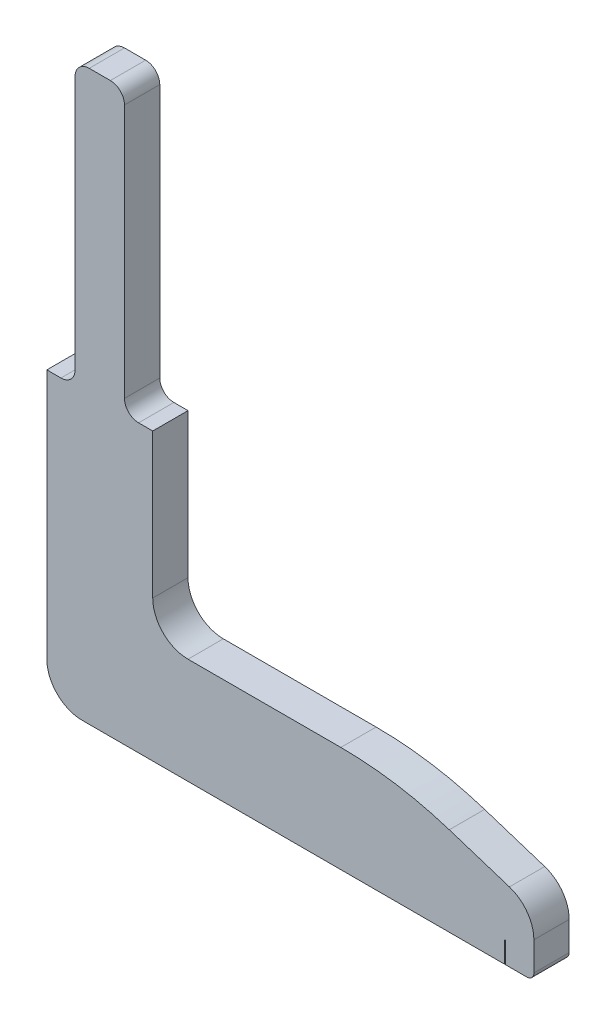
ISO-10303-21;
HEADER;
FILE_DESCRIPTION(('STEP AP214'),'2;1');
FILE_NAME('part.step','',(''),(''),'','','');
FILE_SCHEMA(('AUTOMOTIVE_DESIGN { 1 0 10303 214 1 1 1 1 }'));
ENDSEC;
DATA;
#1=APPLICATION_CONTEXT('core data for automotive mechanical design processes');
#2=APPLICATION_PROTOCOL_DEFINITION('international standard','automotive_design',2000,#1);
#3=PRODUCT_CONTEXT('',#1,'mechanical');
#4=PRODUCT('Part','Part','',(#3));
#5=PRODUCT_RELATED_PRODUCT_CATEGORY('part','',(#4));
#6=PRODUCT_DEFINITION_FORMATION('','',#4);
#7=PRODUCT_DEFINITION_CONTEXT('part definition',#1,'design');
#8=PRODUCT_DEFINITION('design','',#6,#7);
#9=PRODUCT_DEFINITION_SHAPE('','',#8);
#10=(LENGTH_UNIT() NAMED_UNIT(*) SI_UNIT(.MILLI.,.METRE.));
#11=(NAMED_UNIT(*) PLANE_ANGLE_UNIT() SI_UNIT($,.RADIAN.));
#12=(NAMED_UNIT(*) SI_UNIT($,.STERADIAN.) SOLID_ANGLE_UNIT());
#13=UNCERTAINTY_MEASURE_WITH_UNIT(LENGTH_MEASURE(1.E-05),#10,'distance_accuracy_value','');
#14=(GEOMETRIC_REPRESENTATION_CONTEXT(3) GLOBAL_UNCERTAINTY_ASSIGNED_CONTEXT((#13)) GLOBAL_UNIT_ASSIGNED_CONTEXT((#10,
#11,#12)) REPRESENTATION_CONTEXT('',''));
#15=CARTESIAN_POINT('',(0.,0.,0.));
#16=DIRECTION('',(0.,0.,1.));
#17=DIRECTION('',(1.,0.,0.));
#18=AXIS2_PLACEMENT_3D('',#15,#16,#17);
#19=CARTESIAN_POINT('',(5.,-40.5,5.));
#20=DIRECTION('',(0.,1.,0.));
#21=DIRECTION('',(-1.,0.,0.));
#22=AXIS2_PLACEMENT_3D('',#19,#20,#21);
#23=PLANE('',#22);
#24=DIRECTION('',(1.,0.,0.));
#25=VECTOR('',#24,1.);
#26=CARTESIAN_POINT('',(5.,-40.5,5.));
#27=LINE('',#26,#25);
#28=CARTESIAN_POINT('',(64.95,-40.5,5.));
#29=VERTEX_POINT('',#28);
#30=CARTESIAN_POINT('',(68.,-40.5,5.));
#31=VERTEX_POINT('',#30);
#32=EDGE_CURVE('E243',#29,#31,#27,.T.);
#33=ORIENTED_EDGE('',*,*,#32,.F.);
#34=DIRECTION('',(0.,0.,1.));
#35=VECTOR('',#34,1.);
#36=CARTESIAN_POINT('',(64.95,-40.5,0.));
#37=LINE('',#36,#35);
#38=CARTESIAN_POINT('',(64.95,-40.5,0.));
#39=VERTEX_POINT('',#38);
#40=EDGE_CURVE('E204',#39,#29,#37,.T.);
#41=ORIENTED_EDGE('',*,*,#40,.F.);
#42=DIRECTION('',(1.,0.,0.));
#43=VECTOR('',#42,1.);
#44=CARTESIAN_POINT('',(5.,-40.5,0.));
#45=LINE('',#44,#43);
#46=CARTESIAN_POINT('',(68.,-40.5,0.));
#47=VERTEX_POINT('',#46);
#48=EDGE_CURVE('E277',#39,#47,#45,.T.);
#49=ORIENTED_EDGE('',*,*,#48,.T.);
#50=DIRECTION('',(0.,0.,-1.));
#51=VECTOR('',#50,1.);
#52=CARTESIAN_POINT('',(68.,-40.5,5.));
#53=LINE('',#52,#51);
#54=EDGE_CURVE('E332',#31,#47,#53,.T.);
#55=ORIENTED_EDGE('',*,*,#54,.F.);
#56=EDGE_LOOP('',(#33,#41,#49,#55));
#57=FACE_BOUND('',#56,.T.);
#58=ADVANCED_FACE('F36',(#57),#23,.F.);
#59=CARTESIAN_POINT('',(0.,0.,5.));
#60=DIRECTION('',(0.,-1.,0.));
#61=DIRECTION('',(1.,0.,0.));
#62=AXIS2_PLACEMENT_3D('',#59,#60,#61);
#63=PLANE('',#62);
#64=DIRECTION('',(-1.,0.,0.));
#65=VECTOR('',#64,1.);
#66=CARTESIAN_POINT('',(4.,0.,5.));
#67=LINE('',#66,#65);
#68=CARTESIAN_POINT('',(2.,0.,5.));
#69=VERTEX_POINT('',#68);
#70=CARTESIAN_POINT('',(0.,0.,5.));
#71=VERTEX_POINT('',#70);
#72=EDGE_CURVE('E236',#69,#71,#67,.T.);
#73=ORIENTED_EDGE('',*,*,#72,.F.);
#74=DIRECTION('',(0.,0.,-1.));
#75=VECTOR('',#74,1.);
#76=CARTESIAN_POINT('',(2.,0.,0.));
#77=LINE('',#76,#75);
#78=CARTESIAN_POINT('',(2.,0.,0.));
#79=VERTEX_POINT('',#78);
#80=EDGE_CURVE('E366',#69,#79,#77,.T.);
#81=ORIENTED_EDGE('',*,*,#80,.T.);
#82=DIRECTION('',(-1.,0.,0.));
#83=VECTOR('',#82,1.);
#84=CARTESIAN_POINT('',(0.,0.,0.));
#85=LINE('',#84,#83);
#86=CARTESIAN_POINT('',(0.,0.,0.));
#87=VERTEX_POINT('',#86);
#88=EDGE_CURVE('E231',#79,#87,#85,.T.);
#89=ORIENTED_EDGE('',*,*,#88,.T.);
#90=DIRECTION('',(0.,0.,-1.));
#91=VECTOR('',#90,1.);
#92=CARTESIAN_POINT('',(0.,0.,5.));
#93=LINE('',#92,#91);
#94=EDGE_CURVE('E341',#71,#87,#93,.T.);
#95=ORIENTED_EDGE('',*,*,#94,.F.);
#96=EDGE_LOOP('',(#73,#81,#89,#95));
#97=FACE_BOUND('',#96,.T.);
#98=ADVANCED_FACE('F408',(#97),#63,.F.);
#99=CARTESIAN_POINT('',(0.,-1.00000000000001,5.));
#100=DIRECTION('',(1.,0.,0.));
#101=DIRECTION('',(0.,1.,0.));
#102=AXIS2_PLACEMENT_3D('',#99,#100,#101);
#103=PLANE('',#102);
#104=DIRECTION('',(0.,-1.,0.));
#105=VECTOR('',#104,1.);
#106=CARTESIAN_POINT('',(0.,-1.00000000000001,0.));
#107=LINE('',#106,#105);
#108=CARTESIAN_POINT('',(0.,-35.5,0.));
#109=VERTEX_POINT('',#108);
#110=EDGE_CURVE('E273',#87,#109,#107,.T.);
#111=ORIENTED_EDGE('',*,*,#110,.T.);
#112=DIRECTION('',(0.,0.,-1.));
#113=VECTOR('',#112,1.);
#114=CARTESIAN_POINT('',(0.,-35.5,5.));
#115=LINE('',#114,#113);
#116=CARTESIAN_POINT('',(0.,-35.5,5.));
#117=VERTEX_POINT('',#116);
#118=EDGE_CURVE('E338',#117,#109,#115,.T.);
#119=ORIENTED_EDGE('',*,*,#118,.F.);
#120=DIRECTION('',(0.,-1.,0.));
#121=VECTOR('',#120,1.);
#122=CARTESIAN_POINT('',(0.,-1.00000000000001,5.));
#123=LINE('',#122,#121);
#124=EDGE_CURVE('E238',#71,#117,#123,.T.);
#125=ORIENTED_EDGE('',*,*,#124,.F.);
#126=ORIENTED_EDGE('',*,*,#94,.T.);
#127=EDGE_LOOP('',(#111,#119,#125,#126));
#128=FACE_BOUND('',#127,.T.);
#129=ADVANCED_FACE('F416',(#128),#103,.F.);
#130=CARTESIAN_POINT('',(5.,-35.5,5.));
#131=DIRECTION('',(0.,0.,-1.));
#132=DIRECTION('',(-1.,0.,0.));
#133=AXIS2_PLACEMENT_3D('',#130,#131,#132);
#134=CYLINDRICAL_SURFACE('',#133,4.99999999999999);
#135=CARTESIAN_POINT('',(5.,-35.5,0.));
#136=DIRECTION('',(0.,0.,1.));
#137=DIRECTION('',(-1.,0.,0.));
#138=AXIS2_PLACEMENT_3D('',#135,#136,#137);
#139=CIRCLE('',#138,4.99999999999999);
#140=CARTESIAN_POINT('',(5.00000000000001,-40.5,0.));
#141=VERTEX_POINT('',#140);
#142=EDGE_CURVE('E275',#109,#141,#139,.T.);
#143=ORIENTED_EDGE('',*,*,#142,.T.);
#144=DIRECTION('',(0.,0.,-1.));
#145=VECTOR('',#144,1.);
#146=CARTESIAN_POINT('',(5.00000000000001,-40.5,5.));
#147=LINE('',#146,#145);
#148=CARTESIAN_POINT('',(5.00000000000001,-40.5,5.));
#149=VERTEX_POINT('',#148);
#150=EDGE_CURVE('E335',#149,#141,#147,.T.);
#151=ORIENTED_EDGE('',*,*,#150,.F.);
#152=CARTESIAN_POINT('',(5.,-35.5,5.));
#153=DIRECTION('',(0.,0.,1.));
#154=DIRECTION('',(-1.,0.,0.));
#155=AXIS2_PLACEMENT_3D('',#152,#153,#154);
#156=CIRCLE('',#155,4.99999999999999);
#157=EDGE_CURVE('E241',#117,#149,#156,.T.);
#158=ORIENTED_EDGE('',*,*,#157,.F.);
#159=ORIENTED_EDGE('',*,*,#118,.T.);
#160=EDGE_LOOP('',(#143,#151,#158,#159));
#161=FACE_BOUND('',#160,.T.);
#162=ADVANCED_FACE('F421',(#161),#134,.T.);
#163=CARTESIAN_POINT('',(64.85,-40.5,0.));
#164=VERTEX_POINT('',#163);
#165=EDGE_CURVE('E278',#141,#164,#45,.T.);
#166=ORIENTED_EDGE('',*,*,#165,.T.);
#167=DIRECTION('',(0.,0.,-1.));
#168=VECTOR('',#167,1.);
#169=CARTESIAN_POINT('',(64.85,-40.5,0.));
#170=LINE('',#169,#168);
#171=CARTESIAN_POINT('',(64.85,-40.5,5.));
#172=VERTEX_POINT('',#171);
#173=EDGE_CURVE('E217',#172,#164,#170,.T.);
#174=ORIENTED_EDGE('',*,*,#173,.F.);
#175=EDGE_CURVE('E244',#149,#172,#27,.T.);
#176=ORIENTED_EDGE('',*,*,#175,.F.);
#177=ORIENTED_EDGE('',*,*,#150,.T.);
#178=EDGE_LOOP('',(#166,#174,#176,#177));
#179=FACE_BOUND('',#178,.T.);
#180=ADVANCED_FACE('F424',(#179),#23,.F.);
#181=CARTESIAN_POINT('',(68.,-39.5,5.));
#182=DIRECTION('',(0.,0.,-1.));
#183=DIRECTION('',(-1.,0.,0.));
#184=AXIS2_PLACEMENT_3D('',#181,#182,#183);
#185=CYLINDRICAL_SURFACE('',#184,1.);
#186=CARTESIAN_POINT('',(68.,-39.5,0.));
#187=DIRECTION('',(0.,0.,1.));
#188=DIRECTION('',(-1.,0.,0.));
#189=AXIS2_PLACEMENT_3D('',#186,#187,#188);
#190=CIRCLE('',#189,1.);
#191=CARTESIAN_POINT('',(69.,-39.5,0.));
#192=VERTEX_POINT('',#191);
#193=EDGE_CURVE('E281',#47,#192,#190,.T.);
#194=ORIENTED_EDGE('',*,*,#193,.T.);
#195=DIRECTION('',(0.,0.,-1.));
#196=VECTOR('',#195,1.);
#197=CARTESIAN_POINT('',(69.,-39.5,5.));
#198=LINE('',#197,#196);
#199=CARTESIAN_POINT('',(69.,-39.5,5.));
#200=VERTEX_POINT('',#199);
#201=EDGE_CURVE('E329',#200,#192,#198,.T.);
#202=ORIENTED_EDGE('',*,*,#201,.F.);
#203=CARTESIAN_POINT('',(68.,-39.5,5.));
#204=DIRECTION('',(0.,0.,1.));
#205=DIRECTION('',(-1.,0.,0.));
#206=AXIS2_PLACEMENT_3D('',#203,#204,#205);
#207=CIRCLE('',#206,1.);
#208=EDGE_CURVE('E246',#31,#200,#207,.T.);
#209=ORIENTED_EDGE('',*,*,#208,.F.);
#210=ORIENTED_EDGE('',*,*,#54,.T.);
#211=EDGE_LOOP('',(#194,#202,#209,#210));
#212=FACE_BOUND('',#211,.T.);
#213=ADVANCED_FACE('F437',(#212),#185,.T.);
#214=CARTESIAN_POINT('',(69.,-39.5,5.));
#215=DIRECTION('',(-1.,0.,0.));
#216=DIRECTION('',(0.,0.,1.));
#217=AXIS2_PLACEMENT_3D('',#214,#215,#216);
#218=PLANE('',#217);
#219=DIRECTION('',(0.,1.,0.));
#220=VECTOR('',#219,1.);
#221=CARTESIAN_POINT('',(69.,-39.5,0.));
#222=LINE('',#221,#220);
#223=CARTESIAN_POINT('',(69.,-35.4299960458088,0.));
#224=VERTEX_POINT('',#223);
#225=EDGE_CURVE('E283',#192,#224,#222,.T.);
#226=ORIENTED_EDGE('',*,*,#225,.T.);
#227=DIRECTION('',(0.,0.,-1.));
#228=VECTOR('',#227,1.);
#229=CARTESIAN_POINT('',(69.,-35.4299960458088,5.));
#230=LINE('',#229,#228);
#231=CARTESIAN_POINT('',(69.,-35.4299960458088,5.));
#232=VERTEX_POINT('',#231);
#233=EDGE_CURVE('E326',#232,#224,#230,.T.);
#234=ORIENTED_EDGE('',*,*,#233,.F.);
#235=DIRECTION('',(0.,1.,0.));
#236=VECTOR('',#235,1.);
#237=CARTESIAN_POINT('',(69.,-39.5,5.));
#238=LINE('',#237,#236);
#239=EDGE_CURVE('E248',#200,#232,#238,.T.);
#240=ORIENTED_EDGE('',*,*,#239,.F.);
#241=ORIENTED_EDGE('',*,*,#201,.T.);
#242=EDGE_LOOP('',(#226,#234,#240,#241));
#243=FACE_BOUND('',#242,.T.);
#244=ADVANCED_FACE('F440',(#243),#218,.F.);
#245=CARTESIAN_POINT('',(64.,-35.4299960458088,5.));
#246=DIRECTION('',(0.,0.,-1.));
#247=DIRECTION('',(-1.,0.,0.));
#248=AXIS2_PLACEMENT_3D('',#245,#246,#247);
#249=CYLINDRICAL_SURFACE('',#248,5.);
#250=CARTESIAN_POINT('',(64.,-35.4299960458088,0.));
#251=DIRECTION('',(0.,0.,1.));
#252=DIRECTION('',(-1.,0.,0.));
#253=AXIS2_PLACEMENT_3D('',#250,#251,#252);
#254=CIRCLE('',#253,5.);
#255=CARTESIAN_POINT('',(65.536877429929,-30.6720544987346,0.));
#256=VERTEX_POINT('',#255);
#257=EDGE_CURVE('E285',#224,#256,#254,.T.);
#258=ORIENTED_EDGE('',*,*,#257,.T.);
#259=DIRECTION('',(0.,0.,-1.));
#260=VECTOR('',#259,1.);
#261=CARTESIAN_POINT('',(65.536877429929,-30.6720544987346,5.));
#262=LINE('',#261,#260);
#263=CARTESIAN_POINT('',(65.536877429929,-30.6720544987346,5.));
#264=VERTEX_POINT('',#263);
#265=EDGE_CURVE('E323',#264,#256,#262,.T.);
#266=ORIENTED_EDGE('',*,*,#265,.F.);
#267=CARTESIAN_POINT('',(64.,-35.4299960458088,5.));
#268=DIRECTION('',(0.,0.,1.));
#269=DIRECTION('',(-1.,0.,0.));
#270=AXIS2_PLACEMENT_3D('',#267,#268,#269);
#271=CIRCLE('',#270,5.);
#272=EDGE_CURVE('E250',#232,#264,#271,.T.);
#273=ORIENTED_EDGE('',*,*,#272,.F.);
#274=ORIENTED_EDGE('',*,*,#233,.T.);
#275=EDGE_LOOP('',(#258,#266,#273,#274));
#276=FACE_BOUND('',#275,.T.);
#277=ADVANCED_FACE('F445',(#276),#249,.T.);
#278=CARTESIAN_POINT('',(65.536877429929,-30.6720544987346,5.));
#279=DIRECTION('',(-0.307375485985791,-0.951588309414843,0.));
#280=DIRECTION('',(0.951588309414843,-0.307375485985791,0.));
#281=AXIS2_PLACEMENT_3D('',#278,#279,#280);
#282=PLANE('',#281);
#283=DIRECTION('',(-0.951588309414843,0.307375485985791,0.));
#284=VECTOR('',#283,1.);
#285=CARTESIAN_POINT('',(65.536877429929,-30.6720544987346,0.));
#286=LINE('',#285,#284);
#287=CARTESIAN_POINT('',(57.018739920482,-27.9205845292579,0.));
#288=VERTEX_POINT('',#287);
#289=EDGE_CURVE('E287',#256,#288,#286,.T.);
#290=ORIENTED_EDGE('',*,*,#289,.T.);
#291=DIRECTION('',(0.,0.,-1.));
#292=VECTOR('',#291,1.);
#293=CARTESIAN_POINT('',(57.018739920482,-27.9205845292579,5.));
#294=LINE('',#293,#292);
#295=CARTESIAN_POINT('',(57.018739920482,-27.9205845292579,5.));
#296=VERTEX_POINT('',#295);
#297=EDGE_CURVE('E320',#296,#288,#294,.T.);
#298=ORIENTED_EDGE('',*,*,#297,.F.);
#299=DIRECTION('',(-0.951588309414843,0.307375485985791,0.));
#300=VECTOR('',#299,1.);
#301=CARTESIAN_POINT('',(65.536877429929,-30.6720544987346,5.));
#302=LINE('',#301,#300);
#303=EDGE_CURVE('E252',#264,#296,#302,.T.);
#304=ORIENTED_EDGE('',*,*,#303,.F.);
#305=ORIENTED_EDGE('',*,*,#265,.T.);
#306=EDGE_LOOP('',(#290,#298,#304,#305));
#307=FACE_BOUND('',#306,.T.);
#308=ADVANCED_FACE('F451',(#307),#282,.F.);
#309=CARTESIAN_POINT('',(41.6499656211925,-75.5,5.));
#310=DIRECTION('',(0.,0.,-1.));
#311=DIRECTION('',(-1.,0.,0.));
#312=AXIS2_PLACEMENT_3D('',#309,#310,#311);
#313=CYLINDRICAL_SURFACE('',#312,50.);
#314=CARTESIAN_POINT('',(41.6499656211925,-75.5,0.));
#315=DIRECTION('',(0.,0.,1.));
#316=DIRECTION('',(-1.,0.,0.));
#317=AXIS2_PLACEMENT_3D('',#314,#315,#316);
#318=CIRCLE('',#317,50.);
#319=CARTESIAN_POINT('',(41.6499656211925,-25.5,0.));
#320=VERTEX_POINT('',#319);
#321=EDGE_CURVE('E289',#288,#320,#318,.T.);
#322=ORIENTED_EDGE('',*,*,#321,.T.);
#323=DIRECTION('',(0.,0.,-1.));
#324=VECTOR('',#323,1.);
#325=CARTESIAN_POINT('',(41.6499656211925,-25.5,5.));
#326=LINE('',#325,#324);
#327=CARTESIAN_POINT('',(41.6499656211925,-25.5,5.));
#328=VERTEX_POINT('',#327);
#329=EDGE_CURVE('E317',#328,#320,#326,.T.);
#330=ORIENTED_EDGE('',*,*,#329,.F.);
#331=CARTESIAN_POINT('',(41.6499656211925,-75.5,5.));
#332=DIRECTION('',(0.,0.,1.));
#333=DIRECTION('',(-1.,0.,0.));
#334=AXIS2_PLACEMENT_3D('',#331,#332,#333);
#335=CIRCLE('',#334,50.);
#336=EDGE_CURVE('E254',#296,#328,#335,.T.);
#337=ORIENTED_EDGE('',*,*,#336,.F.);
#338=ORIENTED_EDGE('',*,*,#297,.T.);
#339=EDGE_LOOP('',(#322,#330,#337,#338));
#340=FACE_BOUND('',#339,.T.);
#341=ADVANCED_FACE('F455',(#340),#313,.T.);
#342=CARTESIAN_POINT('',(41.6499656211925,-25.5,5.));
#343=DIRECTION('',(0.,-1.,0.));
#344=DIRECTION('',(0.,0.,-1.));
#345=AXIS2_PLACEMENT_3D('',#342,#343,#344);
#346=PLANE('',#345);
#347=DIRECTION('',(-1.,0.,0.));
#348=VECTOR('',#347,1.);
#349=CARTESIAN_POINT('',(41.6499656211925,-25.5,0.));
#350=LINE('',#349,#348);
#351=CARTESIAN_POINT('',(20.,-25.5,0.));
#352=VERTEX_POINT('',#351);
#353=EDGE_CURVE('E291',#320,#352,#350,.T.);
#354=ORIENTED_EDGE('',*,*,#353,.T.);
#355=DIRECTION('',(0.,0.,-1.));
#356=VECTOR('',#355,1.);
#357=CARTESIAN_POINT('',(20.,-25.5,5.));
#358=LINE('',#357,#356);
#359=CARTESIAN_POINT('',(20.,-25.5,5.));
#360=VERTEX_POINT('',#359);
#361=EDGE_CURVE('E314',#360,#352,#358,.T.);
#362=ORIENTED_EDGE('',*,*,#361,.F.);
#363=DIRECTION('',(-1.,0.,0.));
#364=VECTOR('',#363,1.);
#365=CARTESIAN_POINT('',(41.6499656211925,-25.5,5.));
#366=LINE('',#365,#364);
#367=EDGE_CURVE('E256',#328,#360,#366,.T.);
#368=ORIENTED_EDGE('',*,*,#367,.F.);
#369=ORIENTED_EDGE('',*,*,#329,.T.);
#370=EDGE_LOOP('',(#354,#362,#368,#369));
#371=FACE_BOUND('',#370,.T.);
#372=ADVANCED_FACE('F460',(#371),#346,.F.);
#373=CARTESIAN_POINT('',(20.,-20.5,5.));
#374=DIRECTION('',(0.,0.,-1.));
#375=DIRECTION('',(-1.,0.,0.));
#376=AXIS2_PLACEMENT_3D('',#373,#374,#375);
#377=CYLINDRICAL_SURFACE('',#376,5.);
#378=CARTESIAN_POINT('',(20.,-20.5,0.));
#379=DIRECTION('',(0.,0.,-1.));
#380=DIRECTION('',(1.,0.,0.));
#381=AXIS2_PLACEMENT_3D('',#378,#379,#380);
#382=CIRCLE('',#381,5.);
#383=CARTESIAN_POINT('',(15.,-20.5,0.));
#384=VERTEX_POINT('',#383);
#385=EDGE_CURVE('E293',#352,#384,#382,.T.);
#386=ORIENTED_EDGE('',*,*,#385,.T.);
#387=DIRECTION('',(0.,0.,-1.));
#388=VECTOR('',#387,1.);
#389=CARTESIAN_POINT('',(15.,-20.5,5.));
#390=LINE('',#389,#388);
#391=CARTESIAN_POINT('',(15.,-20.5,5.));
#392=VERTEX_POINT('',#391);
#393=EDGE_CURVE('E311',#392,#384,#390,.T.);
#394=ORIENTED_EDGE('',*,*,#393,.F.);
#395=CARTESIAN_POINT('',(20.,-20.5,5.));
#396=DIRECTION('',(0.,0.,-1.));
#397=DIRECTION('',(1.,0.,0.));
#398=AXIS2_PLACEMENT_3D('',#395,#396,#397);
#399=CIRCLE('',#398,5.);
#400=EDGE_CURVE('E258',#360,#392,#399,.T.);
#401=ORIENTED_EDGE('',*,*,#400,.F.);
#402=ORIENTED_EDGE('',*,*,#361,.T.);
#403=EDGE_LOOP('',(#386,#394,#401,#402));
#404=FACE_BOUND('',#403,.T.);
#405=ADVANCED_FACE('F465',(#404),#377,.F.);
#406=CARTESIAN_POINT('',(15.,-1.00000000000001,5.));
#407=DIRECTION('',(-1.,0.,0.));
#408=DIRECTION('',(0.,0.,1.));
#409=AXIS2_PLACEMENT_3D('',#406,#407,#408);
#410=PLANE('',#409);
#411=DIRECTION('',(0.,1.,0.));
#412=VECTOR('',#411,1.);
#413=CARTESIAN_POINT('',(15.,-1.00000000000001,0.));
#414=LINE('',#413,#412);
#415=CARTESIAN_POINT('',(15.,0.,0.));
#416=VERTEX_POINT('',#415);
#417=EDGE_CURVE('E296',#384,#416,#414,.T.);
#418=ORIENTED_EDGE('',*,*,#417,.T.);
#419=DIRECTION('',(0.,0.,-1.));
#420=VECTOR('',#419,1.);
#421=CARTESIAN_POINT('',(15.,0.,5.));
#422=LINE('',#421,#420);
#423=CARTESIAN_POINT('',(15.,0.,5.));
#424=VERTEX_POINT('',#423);
#425=EDGE_CURVE('E271',#424,#416,#422,.T.);
#426=ORIENTED_EDGE('',*,*,#425,.F.);
#427=DIRECTION('',(0.,1.,0.));
#428=VECTOR('',#427,1.);
#429=CARTESIAN_POINT('',(15.,-20.5,5.));
#430=LINE('',#429,#428);
#431=EDGE_CURVE('E260',#392,#424,#430,.T.);
#432=ORIENTED_EDGE('',*,*,#431,.F.);
#433=ORIENTED_EDGE('',*,*,#393,.T.);
#434=EDGE_LOOP('',(#418,#426,#432,#433));
#435=FACE_BOUND('',#434,.T.);
#436=ADVANCED_FACE('F468',(#435),#410,.F.);
#437=CARTESIAN_POINT('',(14.,0.,5.));
#438=DIRECTION('',(0.,-1.,0.));
#439=DIRECTION('',(1.,0.,0.));
#440=AXIS2_PLACEMENT_3D('',#437,#438,#439);
#441=PLANE('',#440);
#442=DIRECTION('',(-1.,0.,0.));
#443=VECTOR('',#442,1.);
#444=CARTESIAN_POINT('',(14.,0.,0.));
#445=LINE('',#444,#443);
#446=CARTESIAN_POINT('',(13.,0.,0.));
#447=VERTEX_POINT('',#446);
#448=EDGE_CURVE('E299',#416,#447,#445,.T.);
#449=ORIENTED_EDGE('',*,*,#448,.T.);
#450=DIRECTION('',(0.,0.,-1.));
#451=VECTOR('',#450,1.);
#452=CARTESIAN_POINT('',(13.,0.,5.));
#453=LINE('',#452,#451);
#454=CARTESIAN_POINT('',(13.,0.,5.));
#455=VERTEX_POINT('',#454);
#456=EDGE_CURVE('E369',#447,#455,#453,.F.);
#457=ORIENTED_EDGE('',*,*,#456,.T.);
#458=DIRECTION('',(-1.,0.,0.));
#459=VECTOR('',#458,1.);
#460=CARTESIAN_POINT('',(15.,0.,5.));
#461=LINE('',#460,#459);
#462=EDGE_CURVE('E262',#424,#455,#461,.T.);
#463=ORIENTED_EDGE('',*,*,#462,.F.);
#464=ORIENTED_EDGE('',*,*,#425,.T.);
#465=EDGE_LOOP('',(#449,#457,#463,#464));
#466=FACE_BOUND('',#465,.T.);
#467=ADVANCED_FACE('F381',(#466),#441,.F.);
#468=CARTESIAN_POINT('',(11.,0.,5.));
#469=DIRECTION('',(-1.,0.,0.));
#470=DIRECTION('',(0.,0.,1.));
#471=AXIS2_PLACEMENT_3D('',#468,#469,#470);
#472=PLANE('',#471);
#473=DIRECTION('',(0.,1.,0.));
#474=VECTOR('',#473,1.);
#475=CARTESIAN_POINT('',(11.,0.,0.));
#476=LINE('',#475,#474);
#477=CARTESIAN_POINT('',(11.,2.,0.));
#478=VERTEX_POINT('',#477);
#479=CARTESIAN_POINT('',(11.,38.,0.));
#480=VERTEX_POINT('',#479);
#481=EDGE_CURVE('E302',#478,#480,#476,.T.);
#482=ORIENTED_EDGE('',*,*,#481,.T.);
#483=DIRECTION('',(0.,0.,-1.));
#484=VECTOR('',#483,1.);
#485=CARTESIAN_POINT('',(11.,38.,5.));
#486=LINE('',#485,#484);
#487=CARTESIAN_POINT('',(11.,38.,5.));
#488=VERTEX_POINT('',#487);
#489=EDGE_CURVE('E59',#480,#488,#486,.F.);
#490=ORIENTED_EDGE('',*,*,#489,.T.);
#491=DIRECTION('',(0.,1.,0.));
#492=VECTOR('',#491,1.);
#493=CARTESIAN_POINT('',(11.,0.,5.));
#494=LINE('',#493,#492);
#495=CARTESIAN_POINT('',(11.,2.,5.));
#496=VERTEX_POINT('',#495);
#497=EDGE_CURVE('E265',#496,#488,#494,.T.);
#498=ORIENTED_EDGE('',*,*,#497,.F.);
#499=DIRECTION('',(0.,0.,-1.));
#500=VECTOR('',#499,1.);
#501=CARTESIAN_POINT('',(11.,2.,0.));
#502=LINE('',#501,#500);
#503=EDGE_CURVE('E362',#496,#478,#502,.T.);
#504=ORIENTED_EDGE('',*,*,#503,.T.);
#505=EDGE_LOOP('',(#482,#490,#498,#504));
#506=FACE_BOUND('',#505,.T.);
#507=ADVANCED_FACE('F386',(#506),#472,.F.);
#508=CARTESIAN_POINT('',(11.,40.,5.));
#509=DIRECTION('',(0.,-1.,0.));
#510=DIRECTION('',(0.,0.,-1.));
#511=AXIS2_PLACEMENT_3D('',#508,#509,#510);
#512=PLANE('',#511);
#513=DIRECTION('',(-1.,0.,0.));
#514=VECTOR('',#513,1.);
#515=CARTESIAN_POINT('',(11.,40.,0.));
#516=LINE('',#515,#514);
#517=CARTESIAN_POINT('',(9.,40.,0.));
#518=VERTEX_POINT('',#517);
#519=CARTESIAN_POINT('',(6.,40.,0.));
#520=VERTEX_POINT('',#519);
#521=EDGE_CURVE('E304',#518,#520,#516,.T.);
#522=ORIENTED_EDGE('',*,*,#521,.T.);
#523=DIRECTION('',(0.,0.,-1.));
#524=VECTOR('',#523,1.);
#525=CARTESIAN_POINT('',(6.,40.,5.));
#526=LINE('',#525,#524);
#527=CARTESIAN_POINT('',(6.,40.,5.));
#528=VERTEX_POINT('',#527);
#529=EDGE_CURVE('E356',#520,#528,#526,.F.);
#530=ORIENTED_EDGE('',*,*,#529,.T.);
#531=DIRECTION('',(-1.,0.,0.));
#532=VECTOR('',#531,1.);
#533=CARTESIAN_POINT('',(11.,40.,5.));
#534=LINE('',#533,#532);
#535=CARTESIAN_POINT('',(9.,40.,5.));
#536=VERTEX_POINT('',#535);
#537=EDGE_CURVE('E267',#536,#528,#534,.T.);
#538=ORIENTED_EDGE('',*,*,#537,.F.);
#539=DIRECTION('',(0.,0.,-1.));
#540=VECTOR('',#539,1.);
#541=CARTESIAN_POINT('',(9.,40.,5.));
#542=LINE('',#541,#540);
#543=EDGE_CURVE('E353',#536,#518,#542,.T.);
#544=ORIENTED_EDGE('',*,*,#543,.T.);
#545=EDGE_LOOP('',(#522,#530,#538,#544));
#546=FACE_BOUND('',#545,.T.);
#547=ADVANCED_FACE('F393',(#546),#512,.F.);
#548=CARTESIAN_POINT('',(4.,0.,5.));
#549=DIRECTION('',(1.,0.,0.));
#550=DIRECTION('',(0.,0.,-1.));
#551=AXIS2_PLACEMENT_3D('',#548,#549,#550);
#552=PLANE('',#551);
#553=DIRECTION('',(0.,-1.,0.));
#554=VECTOR('',#553,1.);
#555=CARTESIAN_POINT('',(4.,0.,5.));
#556=LINE('',#555,#554);
#557=CARTESIAN_POINT('',(4.,38.,5.));
#558=VERTEX_POINT('',#557);
#559=CARTESIAN_POINT('',(4.,2.,5.));
#560=VERTEX_POINT('',#559);
#561=EDGE_CURVE('E269',#558,#560,#556,.T.);
#562=ORIENTED_EDGE('',*,*,#561,.F.);
#563=DIRECTION('',(0.,0.,-1.));
#564=VECTOR('',#563,1.);
#565=CARTESIAN_POINT('',(4.,38.,5.));
#566=LINE('',#565,#564);
#567=CARTESIAN_POINT('',(4.,38.,0.));
#568=VERTEX_POINT('',#567);
#569=EDGE_CURVE('E346',#558,#568,#566,.T.);
#570=ORIENTED_EDGE('',*,*,#569,.T.);
#571=DIRECTION('',(0.,-1.,0.));
#572=VECTOR('',#571,1.);
#573=CARTESIAN_POINT('',(4.,0.,0.));
#574=LINE('',#573,#572);
#575=CARTESIAN_POINT('',(4.,2.,0.));
#576=VERTEX_POINT('',#575);
#577=EDGE_CURVE('E239',#568,#576,#574,.T.);
#578=ORIENTED_EDGE('',*,*,#577,.T.);
#579=DIRECTION('',(0.,0.,-1.));
#580=VECTOR('',#579,1.);
#581=CARTESIAN_POINT('',(4.,2.,5.));
#582=LINE('',#581,#580);
#583=EDGE_CURVE('E344',#576,#560,#582,.F.);
#584=ORIENTED_EDGE('',*,*,#583,.T.);
#585=EDGE_LOOP('',(#562,#570,#578,#584));
#586=FACE_BOUND('',#585,.T.);
#587=ADVANCED_FACE('F401',(#586),#552,.F.);
#588=CARTESIAN_POINT('',(5.,-35.5,5.));
#589=DIRECTION('',(0.,0.,-1.));
#590=DIRECTION('',(-1.,0.,0.));
#591=AXIS2_PLACEMENT_3D('',#588,#589,#590);
#592=PLANE('',#591);
#593=ORIENTED_EDGE('',*,*,#537,.T.);
#594=CARTESIAN_POINT('',(6.,38.,5.));
#595=DIRECTION('',(0.,0.,-1.));
#596=DIRECTION('',(-1.,0.,0.));
#597=AXIS2_PLACEMENT_3D('',#594,#595,#596);
#598=CIRCLE('',#597,2.);
#599=EDGE_CURVE('E360',#528,#558,#598,.F.);
#600=ORIENTED_EDGE('',*,*,#599,.T.);
#601=ORIENTED_EDGE('',*,*,#561,.T.);
#602=CARTESIAN_POINT('',(2.,2.,5.));
#603=DIRECTION('',(0.,0.,-1.));
#604=DIRECTION('',(-1.,0.,0.));
#605=AXIS2_PLACEMENT_3D('',#602,#603,#604);
#606=CIRCLE('',#605,2.);
#607=EDGE_CURVE('E51',#560,#69,#606,.T.);
#608=ORIENTED_EDGE('',*,*,#607,.T.);
#609=ORIENTED_EDGE('',*,*,#72,.T.);
#610=ORIENTED_EDGE('',*,*,#124,.T.);
#611=ORIENTED_EDGE('',*,*,#157,.T.);
#612=ORIENTED_EDGE('',*,*,#175,.T.);
#613=DIRECTION('',(0.,-1.,0.));
#614=VECTOR('',#613,1.);
#615=CARTESIAN_POINT('',(64.85,-37.5,5.));
#616=LINE('',#615,#614);
#617=CARTESIAN_POINT('',(64.85,-37.5,5.));
#618=VERTEX_POINT('',#617);
#619=EDGE_CURVE('E207',#618,#172,#616,.T.);
#620=ORIENTED_EDGE('',*,*,#619,.F.);
#621=DIRECTION('',(-1.,0.,0.));
#622=VECTOR('',#621,1.);
#623=CARTESIAN_POINT('',(64.85,-37.5,5.));
#624=LINE('',#623,#622);
#625=CARTESIAN_POINT('',(64.95,-37.5,5.));
#626=VERTEX_POINT('',#625);
#627=EDGE_CURVE('E213',#626,#618,#624,.T.);
#628=ORIENTED_EDGE('',*,*,#627,.F.);
#629=DIRECTION('',(0.,-1.,0.));
#630=VECTOR('',#629,1.);
#631=CARTESIAN_POINT('',(64.95,-37.5,5.));
#632=LINE('',#631,#630);
#633=EDGE_CURVE('E198',#626,#29,#632,.T.);
#634=ORIENTED_EDGE('',*,*,#633,.T.);
#635=ORIENTED_EDGE('',*,*,#32,.T.);
#636=ORIENTED_EDGE('',*,*,#208,.T.);
#637=ORIENTED_EDGE('',*,*,#239,.T.);
#638=ORIENTED_EDGE('',*,*,#272,.T.);
#639=ORIENTED_EDGE('',*,*,#303,.T.);
#640=ORIENTED_EDGE('',*,*,#336,.T.);
#641=ORIENTED_EDGE('',*,*,#367,.T.);
#642=ORIENTED_EDGE('',*,*,#400,.T.);
#643=ORIENTED_EDGE('',*,*,#431,.T.);
#644=ORIENTED_EDGE('',*,*,#462,.T.);
#645=CARTESIAN_POINT('',(13.,2.,5.));
#646=DIRECTION('',(0.,0.,-1.));
#647=DIRECTION('',(-1.,0.,0.));
#648=AXIS2_PLACEMENT_3D('',#645,#646,#647);
#649=CIRCLE('',#648,2.);
#650=EDGE_CURVE('E12',#455,#496,#649,.T.);
#651=ORIENTED_EDGE('',*,*,#650,.T.);
#652=ORIENTED_EDGE('',*,*,#497,.T.);
#653=CARTESIAN_POINT('',(9.,38.,5.));
#654=DIRECTION('',(0.,0.,-1.));
#655=DIRECTION('',(-1.,0.,0.));
#656=AXIS2_PLACEMENT_3D('',#653,#654,#655);
#657=CIRCLE('',#656,2.);
#658=EDGE_CURVE('E358',#488,#536,#657,.F.);
#659=ORIENTED_EDGE('',*,*,#658,.T.);
#660=EDGE_LOOP('',(#593,#600,#601,#608,#609,#610,#611,#612,#620,#628,#634,#635,#636,#637,#638,
#639,#640,#641,#642,#643,#644,#651,#652,#659));
#661=FACE_BOUND('',#660,.T.);
#662=ADVANCED_FACE('F220',(#661),#592,.F.);
#663=CARTESIAN_POINT('',(5.,-35.5,0.));
#664=DIRECTION('',(0.,0.,-1.));
#665=DIRECTION('',(-1.,0.,0.));
#666=AXIS2_PLACEMENT_3D('',#663,#664,#665);
#667=PLANE('',#666);
#668=ORIENTED_EDGE('',*,*,#577,.F.);
#669=CARTESIAN_POINT('',(6.,38.,0.));
#670=DIRECTION('',(0.,0.,-1.));
#671=DIRECTION('',(-1.,0.,0.));
#672=AXIS2_PLACEMENT_3D('',#669,#670,#671);
#673=CIRCLE('',#672,2.);
#674=EDGE_CURVE('E351',#568,#520,#673,.T.);
#675=ORIENTED_EDGE('',*,*,#674,.T.);
#676=ORIENTED_EDGE('',*,*,#521,.F.);
#677=CARTESIAN_POINT('',(9.,38.,0.));
#678=DIRECTION('',(0.,0.,-1.));
#679=DIRECTION('',(-1.,0.,0.));
#680=AXIS2_PLACEMENT_3D('',#677,#678,#679);
#681=CIRCLE('',#680,2.);
#682=EDGE_CURVE('E349',#518,#480,#681,.T.);
#683=ORIENTED_EDGE('',*,*,#682,.T.);
#684=ORIENTED_EDGE('',*,*,#481,.F.);
#685=CARTESIAN_POINT('',(13.,2.,0.));
#686=DIRECTION('',(0.,0.,-1.));
#687=DIRECTION('',(-1.,0.,0.));
#688=AXIS2_PLACEMENT_3D('',#685,#686,#687);
#689=CIRCLE('',#688,2.);
#690=EDGE_CURVE('E44',#478,#447,#689,.F.);
#691=ORIENTED_EDGE('',*,*,#690,.T.);
#692=ORIENTED_EDGE('',*,*,#448,.F.);
#693=ORIENTED_EDGE('',*,*,#417,.F.);
#694=ORIENTED_EDGE('',*,*,#385,.F.);
#695=ORIENTED_EDGE('',*,*,#353,.F.);
#696=ORIENTED_EDGE('',*,*,#321,.F.);
#697=ORIENTED_EDGE('',*,*,#289,.F.);
#698=ORIENTED_EDGE('',*,*,#257,.F.);
#699=ORIENTED_EDGE('',*,*,#225,.F.);
#700=ORIENTED_EDGE('',*,*,#193,.F.);
#701=ORIENTED_EDGE('',*,*,#48,.F.);
#702=DIRECTION('',(0.,-1.,0.));
#703=VECTOR('',#702,1.);
#704=CARTESIAN_POINT('',(64.95,-37.5,0.));
#705=LINE('',#704,#703);
#706=CARTESIAN_POINT('',(64.95,-37.5,0.));
#707=VERTEX_POINT('',#706);
#708=EDGE_CURVE('E229',#707,#39,#705,.T.);
#709=ORIENTED_EDGE('',*,*,#708,.F.);
#710=DIRECTION('',(1.,0.,0.));
#711=VECTOR('',#710,1.);
#712=CARTESIAN_POINT('',(64.85,-37.5,0.));
#713=LINE('',#712,#711);
#714=CARTESIAN_POINT('',(64.85,-37.5,0.));
#715=VERTEX_POINT('',#714);
#716=EDGE_CURVE('E208',#715,#707,#713,.T.);
#717=ORIENTED_EDGE('',*,*,#716,.F.);
#718=DIRECTION('',(0.,-1.,0.));
#719=VECTOR('',#718,1.);
#720=CARTESIAN_POINT('',(64.85,-37.5,0.));
#721=LINE('',#720,#719);
#722=EDGE_CURVE('E232',#715,#164,#721,.T.);
#723=ORIENTED_EDGE('',*,*,#722,.T.);
#724=ORIENTED_EDGE('',*,*,#165,.F.);
#725=ORIENTED_EDGE('',*,*,#142,.F.);
#726=ORIENTED_EDGE('',*,*,#110,.F.);
#727=ORIENTED_EDGE('',*,*,#88,.F.);
#728=CARTESIAN_POINT('',(2.,2.,0.));
#729=DIRECTION('',(0.,0.,-1.));
#730=DIRECTION('',(-1.,0.,0.));
#731=AXIS2_PLACEMENT_3D('',#728,#729,#730);
#732=CIRCLE('',#731,2.);
#733=EDGE_CURVE('E371',#79,#576,#732,.F.);
#734=ORIENTED_EDGE('',*,*,#733,.T.);
#735=EDGE_LOOP('',(#668,#675,#676,#683,#684,#691,#692,#693,#694,#695,#696,#697,#698,#699,#700,
#701,#709,#717,#723,#724,#725,#726,#727,#734));
#736=FACE_BOUND('',#735,.T.);
#737=ADVANCED_FACE('F376',(#736),#667,.T.);
#738=CARTESIAN_POINT('',(64.95,-37.5,0.));
#739=DIRECTION('',(1.,0.,0.));
#740=DIRECTION('',(0.,0.,-1.));
#741=AXIS2_PLACEMENT_3D('',#738,#739,#740);
#742=PLANE('',#741);
#743=ORIENTED_EDGE('',*,*,#40,.T.);
#744=ORIENTED_EDGE('',*,*,#633,.F.);
#745=DIRECTION('',(0.,0.,1.));
#746=VECTOR('',#745,1.);
#747=CARTESIAN_POINT('',(64.95,-37.5,0.));
#748=LINE('',#747,#746);
#749=EDGE_CURVE('E201',#707,#626,#748,.T.);
#750=ORIENTED_EDGE('',*,*,#749,.F.);
#751=ORIENTED_EDGE('',*,*,#708,.T.);
#752=EDGE_LOOP('',(#743,#744,#750,#751));
#753=FACE_BOUND('',#752,.T.);
#754=ADVANCED_FACE('F200',(#753),#742,.F.);
#755=CARTESIAN_POINT('',(64.85,-37.5,0.));
#756=DIRECTION('',(-1.,0.,0.));
#757=DIRECTION('',(0.,0.,1.));
#758=AXIS2_PLACEMENT_3D('',#755,#756,#757);
#759=PLANE('',#758);
#760=ORIENTED_EDGE('',*,*,#173,.T.);
#761=ORIENTED_EDGE('',*,*,#722,.F.);
#762=DIRECTION('',(0.,0.,-1.));
#763=VECTOR('',#762,1.);
#764=CARTESIAN_POINT('',(64.85,-37.5,0.));
#765=LINE('',#764,#763);
#766=EDGE_CURVE('E222',#618,#715,#765,.T.);
#767=ORIENTED_EDGE('',*,*,#766,.F.);
#768=ORIENTED_EDGE('',*,*,#619,.T.);
#769=EDGE_LOOP('',(#760,#761,#767,#768));
#770=FACE_BOUND('',#769,.T.);
#771=ADVANCED_FACE('F427',(#770),#759,.F.);
#772=CARTESIAN_POINT('',(0.,-37.5,0.));
#773=DIRECTION('',(0.,1.,0.));
#774=DIRECTION('',(0.,0.,1.));
#775=AXIS2_PLACEMENT_3D('',#772,#773,#774);
#776=PLANE('',#775);
#777=ORIENTED_EDGE('',*,*,#749,.T.);
#778=ORIENTED_EDGE('',*,*,#627,.T.);
#779=ORIENTED_EDGE('',*,*,#766,.T.);
#780=ORIENTED_EDGE('',*,*,#716,.T.);
#781=EDGE_LOOP('',(#777,#778,#779,#780));
#782=FACE_BOUND('',#781,.T.);
#783=ADVANCED_FACE('F212',(#782),#776,.F.);
#784=CARTESIAN_POINT('',(6.,38.,5.));
#785=DIRECTION('',(0.,0.,-1.));
#786=DIRECTION('',(-1.,0.,0.));
#787=AXIS2_PLACEMENT_3D('',#784,#785,#786);
#788=CYLINDRICAL_SURFACE('',#787,2.);
#789=ORIENTED_EDGE('',*,*,#599,.F.);
#790=ORIENTED_EDGE('',*,*,#529,.F.);
#791=ORIENTED_EDGE('',*,*,#674,.F.);
#792=ORIENTED_EDGE('',*,*,#569,.F.);
#793=EDGE_LOOP('',(#789,#790,#791,#792));
#794=FACE_BOUND('',#793,.T.);
#795=ADVANCED_FACE('F397',(#794),#788,.T.);
#796=CARTESIAN_POINT('',(9.,38.,5.));
#797=DIRECTION('',(0.,0.,-1.));
#798=DIRECTION('',(-1.,0.,0.));
#799=AXIS2_PLACEMENT_3D('',#796,#797,#798);
#800=CYLINDRICAL_SURFACE('',#799,2.);
#801=ORIENTED_EDGE('',*,*,#658,.F.);
#802=ORIENTED_EDGE('',*,*,#489,.F.);
#803=ORIENTED_EDGE('',*,*,#682,.F.);
#804=ORIENTED_EDGE('',*,*,#543,.F.);
#805=EDGE_LOOP('',(#801,#802,#803,#804));
#806=FACE_BOUND('',#805,.T.);
#807=ADVANCED_FACE('F388',(#806),#800,.T.);
#808=CARTESIAN_POINT('',(2.,2.,5.));
#809=DIRECTION('',(0.,0.,1.));
#810=DIRECTION('',(1.,0.,0.));
#811=AXIS2_PLACEMENT_3D('',#808,#809,#810);
#812=CYLINDRICAL_SURFACE('',#811,2.);
#813=ORIENTED_EDGE('',*,*,#607,.F.);
#814=ORIENTED_EDGE('',*,*,#583,.F.);
#815=ORIENTED_EDGE('',*,*,#733,.F.);
#816=ORIENTED_EDGE('',*,*,#80,.F.);
#817=EDGE_LOOP('',(#813,#814,#815,#816));
#818=FACE_BOUND('',#817,.T.);
#819=ADVANCED_FACE('F404',(#818),#812,.F.);
#820=CARTESIAN_POINT('',(13.,2.,5.));
#821=DIRECTION('',(0.,0.,1.));
#822=DIRECTION('',(1.,0.,0.));
#823=AXIS2_PLACEMENT_3D('',#820,#821,#822);
#824=CYLINDRICAL_SURFACE('',#823,2.);
#825=ORIENTED_EDGE('',*,*,#650,.F.);
#826=ORIENTED_EDGE('',*,*,#456,.F.);
#827=ORIENTED_EDGE('',*,*,#690,.F.);
#828=ORIENTED_EDGE('',*,*,#503,.F.);
#829=EDGE_LOOP('',(#825,#826,#827,#828));
#830=FACE_BOUND('',#829,.T.);
#831=ADVANCED_FACE('F38',(#830),#824,.F.);
#832=CLOSED_SHELL('',(#58,#98,#129,#162,#180,#213,#244,#277,#308,#341,#372,#405,#436,#467,#507,
#547,#587,#662,#737,#754,#771,#783,#795,#807,#819,#831));
#833=MANIFOLD_SOLID_BREP('B2',#832);
#834=ADVANCED_BREP_SHAPE_REPRESENTATION('',(#18,#833),#14);
#835=SHAPE_DEFINITION_REPRESENTATION(#9,#834);
ENDSEC;
END-ISO-10303-21;
